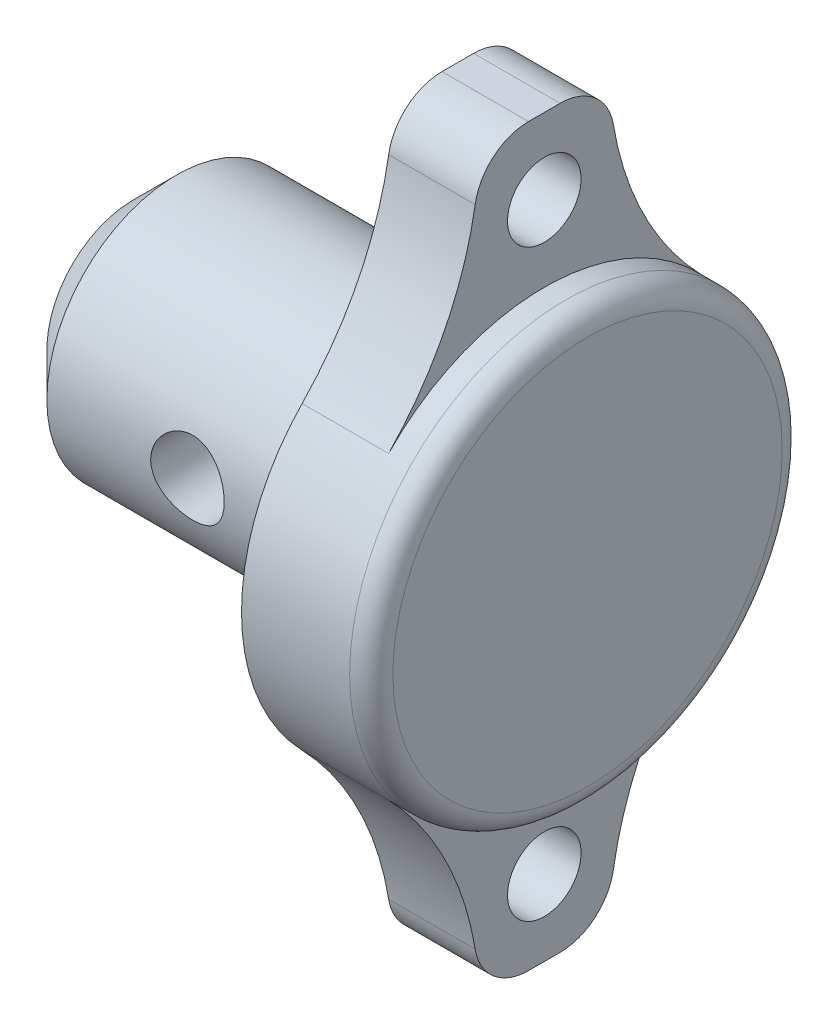
ISO-10303-21;
HEADER;
FILE_DESCRIPTION(('STEP AP214'),'2;1');
FILE_NAME('part.step','',(''),(''),'','','');
FILE_SCHEMA(('AUTOMOTIVE_DESIGN { 1 0 10303 214 1 1 1 1 }'));
ENDSEC;
DATA;
#1=APPLICATION_CONTEXT('core data for automotive mechanical design processes');
#2=APPLICATION_PROTOCOL_DEFINITION('international standard','automotive_design',2000,#1);
#3=PRODUCT_CONTEXT('',#1,'mechanical');
#4=PRODUCT('Part','Part','',(#3));
#5=PRODUCT_RELATED_PRODUCT_CATEGORY('part','',(#4));
#6=PRODUCT_DEFINITION_FORMATION('','',#4);
#7=PRODUCT_DEFINITION_CONTEXT('part definition',#1,'design');
#8=PRODUCT_DEFINITION('design','',#6,#7);
#9=PRODUCT_DEFINITION_SHAPE('','',#8);
#10=(LENGTH_UNIT() NAMED_UNIT(*) SI_UNIT(.MILLI.,.METRE.));
#11=(NAMED_UNIT(*) PLANE_ANGLE_UNIT() SI_UNIT($,.RADIAN.));
#12=(NAMED_UNIT(*) SI_UNIT($,.STERADIAN.) SOLID_ANGLE_UNIT());
#13=UNCERTAINTY_MEASURE_WITH_UNIT(LENGTH_MEASURE(1.E-05),#10,'distance_accuracy_value','');
#14=(GEOMETRIC_REPRESENTATION_CONTEXT(3) GLOBAL_UNCERTAINTY_ASSIGNED_CONTEXT((#13)) GLOBAL_UNIT_ASSIGNED_CONTEXT((#10,
#11,#12)) REPRESENTATION_CONTEXT('',''));
#15=CARTESIAN_POINT('',(0.,0.,0.));
#16=DIRECTION('',(0.,0.,1.));
#17=DIRECTION('',(1.,0.,0.));
#18=AXIS2_PLACEMENT_3D('',#15,#16,#17);
#19=CARTESIAN_POINT('',(13.5,0.,0.));
#20=DIRECTION('',(-1.,0.,0.));
#21=DIRECTION('',(0.,0.,1.));
#22=AXIS2_PLACEMENT_3D('',#19,#20,#21);
#23=CYLINDRICAL_SURFACE('',#22,10.);
#24=CARTESIAN_POINT('',(12.5,0.,0.));
#25=DIRECTION('',(1.,0.,0.));
#26=DIRECTION('',(0.,0.,-1.));
#27=AXIS2_PLACEMENT_3D('',#24,#25,#26);
#28=CIRCLE('',#27,10.);
#29=CARTESIAN_POINT('',(12.5,0.,-10.));
#30=VERTEX_POINT('',#29);
#31=EDGE_CURVE('E11',#30,#30,#28,.F.);
#32=ORIENTED_EDGE('',*,*,#31,.T.);
#33=EDGE_LOOP('',(#32));
#34=FACE_BOUND('',#33,.T.);
#35=CARTESIAN_POINT('',(11.5,0.,0.));
#36=DIRECTION('',(-1.,0.,0.));
#37=DIRECTION('',(0.,0.,1.));
#38=AXIS2_PLACEMENT_3D('',#35,#36,#37);
#39=CIRCLE('',#38,10.);
#40=CARTESIAN_POINT('',(11.5,6.94147083499404,7.19833193503378));
#41=VERTEX_POINT('',#40);
#42=CARTESIAN_POINT('',(11.5,6.94147083499404,-7.19833193503378));
#43=VERTEX_POINT('',#42);
#44=EDGE_CURVE('E288',#41,#43,#39,.T.);
#45=ORIENTED_EDGE('',*,*,#44,.F.);
#46=DIRECTION('',(-1.,0.,0.));
#47=VECTOR('',#46,1.);
#48=CARTESIAN_POINT('',(13.5,6.94147083499404,7.19833193503378));
#49=LINE('',#48,#47);
#50=CARTESIAN_POINT('',(7.5,6.94147083499404,7.19833193503378));
#51=VERTEX_POINT('',#50);
#52=EDGE_CURVE('E285',#41,#51,#49,.T.);
#53=ORIENTED_EDGE('',*,*,#52,.T.);
#54=CARTESIAN_POINT('',(7.5,0.,0.));
#55=DIRECTION('',(1.,0.,0.));
#56=DIRECTION('',(0.,0.,-1.));
#57=AXIS2_PLACEMENT_3D('',#54,#55,#56);
#58=CIRCLE('',#57,10.);
#59=CARTESIAN_POINT('',(7.5,-6.94147083499404,7.19833193503378));
#60=VERTEX_POINT('',#59);
#61=EDGE_CURVE('E155',#51,#60,#58,.T.);
#62=ORIENTED_EDGE('',*,*,#61,.T.);
#63=DIRECTION('',(-1.,0.,0.));
#64=VECTOR('',#63,1.);
#65=CARTESIAN_POINT('',(13.5,-6.94147083499404,7.19833193503378));
#66=LINE('',#65,#64);
#67=CARTESIAN_POINT('',(11.5,-6.94147083499404,7.19833193503378));
#68=VERTEX_POINT('',#67);
#69=EDGE_CURVE('E148',#60,#68,#66,.F.);
#70=ORIENTED_EDGE('',*,*,#69,.T.);
#71=CARTESIAN_POINT('',(11.5,0.,0.));
#72=DIRECTION('',(1.,0.,0.));
#73=DIRECTION('',(0.,0.,1.));
#74=AXIS2_PLACEMENT_3D('',#71,#72,#73);
#75=CIRCLE('',#74,10.);
#76=CARTESIAN_POINT('',(11.5,-6.94147083499404,-7.19833193503378));
#77=VERTEX_POINT('',#76);
#78=EDGE_CURVE('E147',#68,#77,#75,.T.);
#79=ORIENTED_EDGE('',*,*,#78,.T.);
#80=DIRECTION('',(-1.,0.,0.));
#81=VECTOR('',#80,1.);
#82=CARTESIAN_POINT('',(13.5,-6.94147083499404,-7.19833193503378));
#83=LINE('',#82,#81);
#84=CARTESIAN_POINT('',(7.5,-6.94147083499404,-7.19833193503378));
#85=VERTEX_POINT('',#84);
#86=EDGE_CURVE('E131',#77,#85,#83,.T.);
#87=ORIENTED_EDGE('',*,*,#86,.T.);
#88=CARTESIAN_POINT('',(7.5,6.94147083499404,-7.19833193503378));
#89=VERTEX_POINT('',#88);
#90=EDGE_CURVE('E144',#85,#89,#58,.T.);
#91=ORIENTED_EDGE('',*,*,#90,.T.);
#92=DIRECTION('',(-1.,0.,0.));
#93=VECTOR('',#92,1.);
#94=CARTESIAN_POINT('',(13.5,6.94147083499404,-7.19833193503378));
#95=LINE('',#94,#93);
#96=EDGE_CURVE('E168',#89,#43,#95,.F.);
#97=ORIENTED_EDGE('',*,*,#96,.T.);
#98=EDGE_LOOP('',(#45,#53,#62,#70,#79,#87,#91,#97));
#99=FACE_BOUND('',#98,.T.);
#100=ADVANCED_FACE('F34',(#34,#99),#23,.T.);
#101=CARTESIAN_POINT('',(13.5,0.,0.));
#102=DIRECTION('',(1.,0.,0.));
#103=DIRECTION('',(0.,0.,-1.));
#104=AXIS2_PLACEMENT_3D('',#101,#102,#103);
#105=PLANE('',#104);
#106=CARTESIAN_POINT('',(13.5,0.,0.));
#107=DIRECTION('',(1.,0.,0.));
#108=DIRECTION('',(0.,0.,-1.));
#109=AXIS2_PLACEMENT_3D('',#106,#107,#108);
#110=CIRCLE('',#109,9.);
#111=CARTESIAN_POINT('',(13.5,0.,-9.));
#112=VERTEX_POINT('',#111);
#113=EDGE_CURVE('E42',#112,#112,#110,.T.);
#114=ORIENTED_EDGE('',*,*,#113,.T.);
#115=EDGE_LOOP('',(#114));
#116=FACE_BOUND('',#115,.T.);
#117=ADVANCED_FACE('F219',(#116),#105,.T.);
#118=CARTESIAN_POINT('',(7.5,0.,0.));
#119=DIRECTION('',(1.,0.,0.));
#120=DIRECTION('',(0.,0.,-1.));
#121=AXIS2_PLACEMENT_3D('',#118,#119,#120);
#122=PLANE('',#121);
#123=CARTESIAN_POINT('',(7.5,0.,0.));
#124=DIRECTION('',(-1.,0.,0.));
#125=DIRECTION('',(0.,0.,1.));
#126=AXIS2_PLACEMENT_3D('',#123,#124,#125);
#127=CIRCLE('',#126,8.5);
#128=CARTESIAN_POINT('',(7.5,0.,8.5));
#129=VERTEX_POINT('',#128);
#130=EDGE_CURVE('E160',#129,#129,#127,.T.);
#131=ORIENTED_EDGE('',*,*,#130,.F.);
#132=EDGE_LOOP('',(#131));
#133=FACE_BOUND('',#132,.T.);
#134=DIRECTION('',(0.,0.,1.));
#135=VECTOR('',#134,1.);
#136=CARTESIAN_POINT('',(7.5,17.,3.));
#137=LINE('',#136,#135);
#138=CARTESIAN_POINT('',(7.5,17.,-0.730068137608321));
#139=VERTEX_POINT('',#138);
#140=CARTESIAN_POINT('',(7.5,17.,0.730068137608328));
#141=VERTEX_POINT('',#140);
#142=EDGE_CURVE('E303',#139,#141,#137,.T.);
#143=ORIENTED_EDGE('',*,*,#142,.F.);
#144=CARTESIAN_POINT('',(7.5,14.5,-0.730068137608321));
#145=DIRECTION('',(1.,0.,0.));
#146=DIRECTION('',(0.,0.,-1.));
#147=AXIS2_PLACEMENT_3D('',#144,#145,#146);
#148=CIRCLE('',#147,2.5);
#149=CARTESIAN_POINT('',(7.5,14.907668155355,-3.1966055233192));
#150=VERTEX_POINT('',#149);
#151=EDGE_CURVE('E263',#139,#150,#148,.F.);
#152=ORIENTED_EDGE('',*,*,#151,.T.);
#153=CARTESIAN_POINT('',(7.5,17.3536770874851,-17.9958298375844));
#154=DIRECTION('',(1.,0.,0.));
#155=DIRECTION('',(0.,0.,-1.));
#156=AXIS2_PLACEMENT_3D('',#153,#154,#155);
#157=CIRCLE('',#156,15.);
#158=EDGE_CURVE('E154',#150,#89,#157,.T.);
#159=ORIENTED_EDGE('',*,*,#158,.T.);
#160=ORIENTED_EDGE('',*,*,#90,.F.);
#161=CARTESIAN_POINT('',(7.5,-17.3536770874851,-17.9958298375844));
#162=DIRECTION('',(1.,0.,0.));
#163=DIRECTION('',(0.,0.,-1.));
#164=AXIS2_PLACEMENT_3D('',#161,#162,#163);
#165=CIRCLE('',#164,15.);
#166=CARTESIAN_POINT('',(7.5,-14.907668155355,-3.1966055233192));
#167=VERTEX_POINT('',#166);
#168=EDGE_CURVE('E127',#85,#167,#165,.T.);
#169=ORIENTED_EDGE('',*,*,#168,.T.);
#170=CARTESIAN_POINT('',(7.5,-14.5,-0.730068137608321));
#171=DIRECTION('',(1.,0.,0.));
#172=DIRECTION('',(0.,0.,-1.));
#173=AXIS2_PLACEMENT_3D('',#170,#171,#172);
#174=CIRCLE('',#173,2.5);
#175=CARTESIAN_POINT('',(7.5,-17.,-0.730068137608321));
#176=VERTEX_POINT('',#175);
#177=EDGE_CURVE('E267',#167,#176,#174,.F.);
#178=ORIENTED_EDGE('',*,*,#177,.T.);
#179=DIRECTION('',(0.,0.,1.));
#180=VECTOR('',#179,1.);
#181=CARTESIAN_POINT('',(7.5,-17.,3.));
#182=LINE('',#181,#180);
#183=CARTESIAN_POINT('',(7.5,-17.,0.730068137608328));
#184=VERTEX_POINT('',#183);
#185=EDGE_CURVE('E316',#176,#184,#182,.T.);
#186=ORIENTED_EDGE('',*,*,#185,.T.);
#187=CARTESIAN_POINT('',(7.5,-14.5,0.730068137608328));
#188=DIRECTION('',(1.,0.,0.));
#189=DIRECTION('',(0.,0.,-1.));
#190=AXIS2_PLACEMENT_3D('',#187,#188,#189);
#191=CIRCLE('',#190,2.5);
#192=CARTESIAN_POINT('',(7.5,-14.907668155355,3.1966055233192));
#193=VERTEX_POINT('',#192);
#194=EDGE_CURVE('E269',#184,#193,#191,.F.);
#195=ORIENTED_EDGE('',*,*,#194,.T.);
#196=CARTESIAN_POINT('',(7.5,-17.3536770874851,17.9958298375845));
#197=DIRECTION('',(1.,0.,0.));
#198=DIRECTION('',(0.,0.,-1.));
#199=AXIS2_PLACEMENT_3D('',#196,#197,#198);
#200=CIRCLE('',#199,15.);
#201=EDGE_CURVE('E164',#193,#60,#200,.T.);
#202=ORIENTED_EDGE('',*,*,#201,.T.);
#203=ORIENTED_EDGE('',*,*,#61,.F.);
#204=CARTESIAN_POINT('',(7.5,17.3536770874851,17.9958298375845));
#205=DIRECTION('',(1.,0.,0.));
#206=DIRECTION('',(0.,0.,-1.));
#207=AXIS2_PLACEMENT_3D('',#204,#205,#206);
#208=CIRCLE('',#207,15.);
#209=CARTESIAN_POINT('',(7.5,14.907668155355,3.1966055233192));
#210=VERTEX_POINT('',#209);
#211=EDGE_CURVE('E282',#51,#210,#208,.T.);
#212=ORIENTED_EDGE('',*,*,#211,.T.);
#213=CARTESIAN_POINT('',(7.5,14.5,0.730068137608328));
#214=DIRECTION('',(1.,0.,0.));
#215=DIRECTION('',(0.,0.,-1.));
#216=AXIS2_PLACEMENT_3D('',#213,#214,#215);
#217=CIRCLE('',#216,2.5);
#218=EDGE_CURVE('E265',#210,#141,#217,.F.);
#219=ORIENTED_EDGE('',*,*,#218,.T.);
#220=EDGE_LOOP('',(#143,#152,#159,#160,#169,#178,#186,#195,#202,#203,#212,#219));
#221=FACE_BOUND('',#220,.T.);
#222=CARTESIAN_POINT('',(7.5,-13.5,0.));
#223=DIRECTION('',(-1.,0.,0.));
#224=DIRECTION('',(0.,0.,1.));
#225=AXIS2_PLACEMENT_3D('',#222,#223,#224);
#226=CIRCLE('',#225,1.7);
#227=CARTESIAN_POINT('',(7.5,-13.5,1.7));
#228=VERTEX_POINT('',#227);
#229=EDGE_CURVE('E317',#228,#228,#226,.T.);
#230=ORIENTED_EDGE('',*,*,#229,.F.);
#231=EDGE_LOOP('',(#230));
#232=FACE_BOUND('',#231,.T.);
#233=CARTESIAN_POINT('',(7.5,13.5,0.));
#234=DIRECTION('',(1.,0.,0.));
#235=DIRECTION('',(0.,0.,1.));
#236=AXIS2_PLACEMENT_3D('',#233,#234,#235);
#237=CIRCLE('',#236,1.7);
#238=CARTESIAN_POINT('',(7.5,13.5,1.7));
#239=VERTEX_POINT('',#238);
#240=EDGE_CURVE('E309',#239,#239,#237,.T.);
#241=ORIENTED_EDGE('',*,*,#240,.T.);
#242=EDGE_LOOP('',(#241));
#243=FACE_BOUND('',#242,.T.);
#244=ADVANCED_FACE('F151',(#133,#221,#232,#243),#122,.F.);
#245=CARTESIAN_POINT('',(10.,0.,0.));
#246=DIRECTION('',(-1.,0.,0.));
#247=DIRECTION('',(0.,0.,1.));
#248=AXIS2_PLACEMENT_3D('',#245,#246,#247);
#249=CYLINDRICAL_SURFACE('',#248,8.5);
#250=CARTESIAN_POINT('',(10.,0.,0.));
#251=DIRECTION('',(-1.,0.,0.));
#252=DIRECTION('',(0.,0.,1.));
#253=AXIS2_PLACEMENT_3D('',#250,#251,#252);
#254=CIRCLE('',#253,8.5);
#255=CARTESIAN_POINT('',(10.,0.,8.5));
#256=VERTEX_POINT('',#255);
#257=EDGE_CURVE('E158',#256,#256,#254,.T.);
#258=ORIENTED_EDGE('',*,*,#257,.F.);
#259=EDGE_LOOP('',(#258));
#260=FACE_BOUND('',#259,.T.);
#261=ORIENTED_EDGE('',*,*,#130,.T.);
#262=EDGE_LOOP('',(#261));
#263=FACE_BOUND('',#262,.T.);
#264=ADVANCED_FACE('F214',(#260,#263),#249,.F.);
#265=CARTESIAN_POINT('',(10.,0.,0.));
#266=DIRECTION('',(-1.,0.,0.));
#267=DIRECTION('',(0.,0.,1.));
#268=AXIS2_PLACEMENT_3D('',#265,#266,#267);
#269=PLANE('',#268);
#270=CARTESIAN_POINT('',(10.,0.,0.));
#271=DIRECTION('',(-1.,0.,0.));
#272=DIRECTION('',(0.,0.,1.));
#273=AXIS2_PLACEMENT_3D('',#270,#271,#272);
#274=CIRCLE('',#273,6.);
#275=CARTESIAN_POINT('',(10.,0.,6.));
#276=VERTEX_POINT('',#275);
#277=EDGE_CURVE('E323',#276,#276,#274,.T.);
#278=ORIENTED_EDGE('',*,*,#277,.F.);
#279=EDGE_LOOP('',(#278));
#280=FACE_BOUND('',#279,.T.);
#281=ORIENTED_EDGE('',*,*,#257,.T.);
#282=EDGE_LOOP('',(#281));
#283=FACE_BOUND('',#282,.T.);
#284=ADVANCED_FACE('F210',(#280,#283),#269,.T.);
#285=CARTESIAN_POINT('',(-7.5,0.,0.));
#286=DIRECTION('',(1.,0.,0.));
#287=DIRECTION('',(0.,0.,-1.));
#288=AXIS2_PLACEMENT_3D('',#285,#286,#287);
#289=PLANE('',#288);
#290=CARTESIAN_POINT('',(-7.5,0.,0.));
#291=DIRECTION('',(1.,0.,0.));
#292=DIRECTION('',(0.,0.,-1.));
#293=AXIS2_PLACEMENT_3D('',#290,#291,#292);
#294=CIRCLE('',#293,3.99999999999999);
#295=CARTESIAN_POINT('',(-7.5,0.,-3.99999999999999));
#296=VERTEX_POINT('',#295);
#297=EDGE_CURVE('E236',#296,#296,#294,.F.);
#298=ORIENTED_EDGE('',*,*,#297,.T.);
#299=EDGE_LOOP('',(#298));
#300=FACE_BOUND('',#299,.T.);
#301=ADVANCED_FACE('F213',(#300),#289,.F.);
#302=CARTESIAN_POINT('',(7.5,0.,0.));
#303=DIRECTION('',(-1.,0.,0.));
#304=DIRECTION('',(0.,0.,1.));
#305=AXIS2_PLACEMENT_3D('',#302,#303,#304);
#306=CYLINDRICAL_SURFACE('',#305,6.);
#307=CARTESIAN_POINT('',(-5.5,0.,0.));
#308=DIRECTION('',(1.,0.,0.));
#309=DIRECTION('',(0.,0.,-1.));
#310=AXIS2_PLACEMENT_3D('',#307,#308,#309);
#311=CIRCLE('',#310,6.);
#312=CARTESIAN_POINT('',(-5.5,0.,-6.));
#313=VERTEX_POINT('',#312);
#314=EDGE_CURVE('E238',#313,#313,#311,.T.);
#315=ORIENTED_EDGE('',*,*,#314,.T.);
#316=EDGE_LOOP('',(#315));
#317=FACE_BOUND('',#316,.T.);
#318=CARTESIAN_POINT('',(2.7,0.,6.));
#319=CARTESIAN_POINT('',(2.69999827257656,-0.0934943615034012,5.99999884474973));
#320=CARTESIAN_POINT('',(2.69226144726259,-0.187006564522406,5.99779348954783));
#321=CARTESIAN_POINT('',(2.66158237131767,-0.371322769901869,5.98921065514552));
#322=CARTESIAN_POINT('',(2.63863416706838,-0.462125697324879,5.9828315423807));
#323=CARTESIAN_POINT('',(2.57834909427065,-0.638337255167614,5.96660280778705));
#324=CARTESIAN_POINT('',(2.54103209511171,-0.72375314587583,5.95675798000671));
#325=CARTESIAN_POINT('',(2.45314623450544,-0.887114983810657,5.93462982256613));
#326=CARTESIAN_POINT('',(2.40257604953212,-0.965060183916337,5.92234624939093));
#327=CARTESIAN_POINT('',(2.28823799703864,-1.11328637042325,5.89630337319782));
#328=CARTESIAN_POINT('',(2.22419005108989,-1.18334643738983,5.88251635209784));
#329=CARTESIAN_POINT('',(2.08531237424007,-1.31188873147318,5.855192174518));
#330=CARTESIAN_POINT('',(2.01048106015959,-1.37036925552041,5.84165505505769));
#331=CARTESIAN_POINT('',(1.85034613797822,-1.47521073956825,5.81607525435004));
#332=CARTESIAN_POINT('',(1.76486516017767,-1.52131004368505,5.80406729594488));
#333=CARTESIAN_POINT('',(1.58696976467728,-1.5983922398814,5.78331625999126));
#334=CARTESIAN_POINT('',(1.49455681554212,-1.62937832337737,5.77457249324418));
#335=CARTESIAN_POINT('',(1.3078845980668,-1.67457292272021,5.76162732490899));
#336=CARTESIAN_POINT('',(1.21373087719834,-1.68918533732791,5.75731679770698));
#337=CARTESIAN_POINT('',(1.02421729173523,-1.70247807029528,5.75340078755233));
#338=CARTESIAN_POINT('',(0.928857688755669,-1.701161787085,5.7537943009799));
#339=CARTESIAN_POINT('',(0.742854678836455,-1.68295347341345,5.7591447009774));
#340=CARTESIAN_POINT('',(0.652157755737527,-1.66655840082521,5.76395598115783));
#341=CARTESIAN_POINT('',(0.474858143945474,-1.6194572353209,5.77736548810719));
#342=CARTESIAN_POINT('',(0.388255820635804,-1.58874986788554,5.78596405213248));
#343=CARTESIAN_POINT('',(0.220347380346021,-1.51351000123897,5.80610149854683));
#344=CARTESIAN_POINT('',(0.139120886376898,-1.46880968051772,5.81767575077005));
#345=CARTESIAN_POINT('',(-0.0148489487733143,-1.36696961936581,5.84244242021042));
#346=CARTESIAN_POINT('',(-0.0875904236817384,-1.30982715018845,5.8556351921153));
#347=CARTESIAN_POINT('',(-0.225354944278259,-1.1822192440219,5.88275097092072));
#348=CARTESIAN_POINT('',(-0.28999242452938,-1.11133880736879,5.89668292807973));
#349=CARTESIAN_POINT('',(-0.406547682255653,-0.959571971132524,5.92327174812674));
#350=CARTESIAN_POINT('',(-0.458464822119334,-0.878685070277584,5.93592854707829));
#351=CARTESIAN_POINT('',(-0.548306215741749,-0.708554093591207,5.95863625978762));
#352=CARTESIAN_POINT('',(-0.586153059859388,-0.619267075909292,5.96867266972164));
#353=CARTESIAN_POINT('',(-0.646183678571939,-0.435246656631164,5.98490423413323));
#354=CARTESIAN_POINT('',(-0.668371333226229,-0.340514610508734,5.99110034012117));
#355=CARTESIAN_POINT('',(-0.695830668900755,-0.151577478778789,5.99880603608526));
#356=CARTESIAN_POINT('',(-0.701625721825776,-0.0574542537963866,6.00046057332172));
#357=CARTESIAN_POINT('',(-0.697591204441606,0.130421977345627,5.9993175792947));
#358=CARTESIAN_POINT('',(-0.687763475140382,0.224175025822194,5.99652057260661));
#359=CARTESIAN_POINT('',(-0.653188924092887,0.406729377316999,5.98688305950992));
#360=CARTESIAN_POINT('',(-0.628740786388524,0.495591923936864,5.98012355710591));
#361=CARTESIAN_POINT('',(-0.565972324126039,0.667940689340888,5.96333456274326));
#362=CARTESIAN_POINT('',(-0.527650406914014,0.75142628957672,5.95330469537305));
#363=CARTESIAN_POINT('',(-0.437296727112403,0.91263270970203,5.93075651627411));
#364=CARTESIAN_POINT('',(-0.384989188834524,0.990191980587499,5.91818955622035));
#365=CARTESIAN_POINT('',(-0.268489976104551,1.13561335455067,5.89201584767508));
#366=CARTESIAN_POINT('',(-0.204295643566763,1.20347328266756,5.87840886701804));
#367=CARTESIAN_POINT('',(-0.063392937972921,1.32982443029663,5.85114386688352));
#368=CARTESIAN_POINT('',(0.013651209472902,1.38794463053242,5.83749825142035));
#369=CARTESIAN_POINT('',(0.17669281369744,1.49044819284287,5.81217362193036));
#370=CARTESIAN_POINT('',(0.262689948727695,1.53483204834056,5.8004945372707));
#371=CARTESIAN_POINT('',(0.440828399376133,1.60827718214857,5.78056173167497));
#372=CARTESIAN_POINT('',(0.532933542717278,1.63742092705125,5.77228962787091));
#373=CARTESIAN_POINT('',(0.721016522241371,1.67971782463611,5.7601251451254));
#374=CARTESIAN_POINT('',(0.816993200471226,1.69287572248445,5.75623146653765));
#375=CARTESIAN_POINT('',(1.00627001476008,1.70252951716923,5.75338292703647));
#376=CARTESIAN_POINT('',(1.09953728637873,1.69962567840782,5.75425013160161));
#377=CARTESIAN_POINT('',(1.28419429237689,1.67865052041337,5.76040357418625));
#378=CARTESIAN_POINT('',(1.37558408737539,1.66057969167523,5.76568966930041));
#379=CARTESIAN_POINT('',(1.5530269910296,1.61015145481415,5.77997263333106));
#380=CARTESIAN_POINT('',(1.6391238371912,1.57793668021413,5.78893239723693));
#381=CARTESIAN_POINT('',(1.80475829364648,1.50024531465022,5.80955007293793));
#382=CARTESIAN_POINT('',(1.88429475614293,1.45476640929609,5.82120845552789));
#383=CARTESIAN_POINT('',(2.03737751931617,1.35008379150968,5.8463884630186));
#384=CARTESIAN_POINT('',(2.11064083646234,1.29047793558559,5.85995875148063));
#385=CARTESIAN_POINT('',(2.24632007551774,1.1599781975744,5.88717982502643));
#386=CARTESIAN_POINT('',(2.30873327463631,1.08908149062452,5.9008306294293));
#387=CARTESIAN_POINT('',(2.42249103235592,0.935867716703179,5.92708482484926));
#388=CARTESIAN_POINT('',(2.47351858339861,0.853308739764468,5.93965334227066));
#389=CARTESIAN_POINT('',(2.56089262257089,0.680428083863563,5.96192854356138));
#390=CARTESIAN_POINT('',(2.59724731644336,0.590110778092927,5.97163682618414));
#391=CARTESIAN_POINT('',(2.65021388257585,0.416948403338608,5.98603807698347));
#392=CARTESIAN_POINT('',(2.66883690968153,0.334755102796878,5.99123321349682));
#393=CARTESIAN_POINT('',(2.69372995029414,0.168379186148406,5.99821447554217));
#394=CARTESIAN_POINT('',(2.70000155564006,0.0841968278048554,6.00000104036657));
#395=CARTESIAN_POINT('',(2.7,0.,6.));
#396=B_SPLINE_CURVE_WITH_KNOTS('',3,(#318,#319,#320,#321,#322,#323,#324,#325,#326,#327,#328,
#329,#330,#331,#332,#333,#334,#335,#336,#337,#338,#339,#340,#341,#342,#343,#344,#345,#346,#347,
#348,#349,#350,#351,#352,#353,#354,#355,#356,#357,#358,#359,#360,#361,#362,#363,#364,#365,#366,
#367,#368,#369,#370,#371,#372,#373,#374,#375,#376,#377,#378,#379,#380,#381,#382,#383,#384,#385,
#386,#387,#388,#389,#390,#391,#392,#393,#394,#395),.UNSPECIFIED.,.T.,.F.,(4,2,2,2,2,2,2,2,2,2,2,
2,2,2,2,2,2,2,2,2,2,2,2,2,2,2,2,2,2,2,2,2,2,2,2,2,2,2,4),(0.,0.280174071102462,
0.560457865011478,0.84035546210045,1.12028102174913,1.40672953049703,1.69322013762187,
1.98535867662736,2.27743549881932,2.56213698300402,2.84677772644094,3.12236111340167,
3.39796904593474,3.67701797004889,3.95612815546202,4.24557394804681,4.53503424623542,
4.82606427553573,5.11702216760168,5.39857959937197,5.68010385452596,5.95606435426587,
6.23205654320785,6.51395347645871,6.79591352286414,7.0869318850341,7.37793979232426,
7.66735627667048,7.95668683093711,8.23527925900378,8.51386267784062,8.78969905467389,
9.06558358960692,9.3505402059299,9.63556822799412,9.92774771861145,10.2197635817238,
10.4721083055922,10.7244205053941),.UNSPECIFIED.);
#397=CARTESIAN_POINT('',(2.7,0.,6.));
#398=VERTEX_POINT('',#397);
#399=EDGE_CURVE('E177',#398,#398,#396,.T.);
#400=ORIENTED_EDGE('',*,*,#399,.T.);
#401=EDGE_LOOP('',(#400));
#402=FACE_BOUND('',#401,.T.);
#403=CARTESIAN_POINT('',(2.7,0.,-6.));
#404=CARTESIAN_POINT('',(2.69999827257656,0.0934943615034011,-5.99999884474973));
#405=CARTESIAN_POINT('',(2.69226144726259,0.187006564522406,-5.99779348954783));
#406=CARTESIAN_POINT('',(2.66158237131767,0.371322769901869,-5.98921065514552));
#407=CARTESIAN_POINT('',(2.63863416706838,0.462125697324879,-5.9828315423807));
#408=CARTESIAN_POINT('',(2.57834909427065,0.638337255167614,-5.96660280778705));
#409=CARTESIAN_POINT('',(2.54103209511171,0.72375314587583,-5.95675798000671));
#410=CARTESIAN_POINT('',(2.45314623450544,0.887114983810657,-5.93462982256612));
#411=CARTESIAN_POINT('',(2.40257604953212,0.965060183916337,-5.92234624939093));
#412=CARTESIAN_POINT('',(2.28823799703864,1.11328637042325,-5.89630337319782));
#413=CARTESIAN_POINT('',(2.2241900510899,1.18334643738983,-5.88251635209784));
#414=CARTESIAN_POINT('',(2.08531237424007,1.31188873147318,-5.855192174518));
#415=CARTESIAN_POINT('',(2.01048106015959,1.37036925552041,-5.84165505505769));
#416=CARTESIAN_POINT('',(1.85034613797822,1.47521073956825,-5.81607525435004));
#417=CARTESIAN_POINT('',(1.76486516017767,1.52131004368505,-5.80406729594488));
#418=CARTESIAN_POINT('',(1.58696976467728,1.5983922398814,-5.78331625999126));
#419=CARTESIAN_POINT('',(1.49455681554212,1.62937832337737,-5.77457249324418));
#420=CARTESIAN_POINT('',(1.3078845980668,1.67457292272021,-5.76162732490899));
#421=CARTESIAN_POINT('',(1.21373087719834,1.68918533732791,-5.75731679770698));
#422=CARTESIAN_POINT('',(1.02421729173523,1.70247807029528,-5.75340078755233));
#423=CARTESIAN_POINT('',(0.92885768875567,1.701161787085,-5.7537943009799));
#424=CARTESIAN_POINT('',(0.742854678836455,1.68295347341345,-5.7591447009774));
#425=CARTESIAN_POINT('',(0.652157755737527,1.66655840082521,-5.76395598115783));
#426=CARTESIAN_POINT('',(0.474858143945474,1.6194572353209,-5.77736548810719));
#427=CARTESIAN_POINT('',(0.388255820635804,1.58874986788554,-5.78596405213248));
#428=CARTESIAN_POINT('',(0.22034738034602,1.51351000123897,-5.80610149854683));
#429=CARTESIAN_POINT('',(0.139120886376898,1.46880968051772,-5.81767575077005));
#430=CARTESIAN_POINT('',(-0.014848948773315,1.36696961936581,-5.84244242021042));
#431=CARTESIAN_POINT('',(-0.0875904236817389,1.30982715018844,-5.8556351921153));
#432=CARTESIAN_POINT('',(-0.225354944278259,1.1822192440219,-5.88275097092072));
#433=CARTESIAN_POINT('',(-0.289992424529381,1.11133880736879,-5.89668292807973));
#434=CARTESIAN_POINT('',(-0.406547682255654,0.959571971132523,-5.92327174812674));
#435=CARTESIAN_POINT('',(-0.458464822119335,0.878685070277584,-5.93592854707829));
#436=CARTESIAN_POINT('',(-0.548306215741749,0.708554093591207,-5.95863625978762));
#437=CARTESIAN_POINT('',(-0.586153059859388,0.619267075909292,-5.96867266972164));
#438=CARTESIAN_POINT('',(-0.646183678571939,0.435246656631163,-5.98490423413323));
#439=CARTESIAN_POINT('',(-0.668371333226229,0.340514610508733,-5.99110034012117));
#440=CARTESIAN_POINT('',(-0.695830668900755,0.151577478778789,-5.99880603608526));
#441=CARTESIAN_POINT('',(-0.701625721825776,0.0574542537963867,-6.00046057332172));
#442=CARTESIAN_POINT('',(-0.697591204441606,-0.130421977345627,-5.9993175792947));
#443=CARTESIAN_POINT('',(-0.687763475140382,-0.224175025822194,-5.99652057260661));
#444=CARTESIAN_POINT('',(-0.653188924092887,-0.406729377316998,-5.98688305950992));
#445=CARTESIAN_POINT('',(-0.628740786388524,-0.495591923936864,-5.98012355710591));
#446=CARTESIAN_POINT('',(-0.565972324126039,-0.667940689340887,-5.96333456274326));
#447=CARTESIAN_POINT('',(-0.527650406914014,-0.751426289576719,-5.95330469537305));
#448=CARTESIAN_POINT('',(-0.437296727112403,-0.91263270970203,-5.93075651627411));
#449=CARTESIAN_POINT('',(-0.384989188834525,-0.990191980587498,-5.91818955622034));
#450=CARTESIAN_POINT('',(-0.268489976104552,-1.13561335455067,-5.89201584767508));
#451=CARTESIAN_POINT('',(-0.204295643566764,-1.20347328266756,-5.87840886701804));
#452=CARTESIAN_POINT('',(-0.0633929379729218,-1.32982443029663,-5.85114386688352));
#453=CARTESIAN_POINT('',(0.013651209472901,-1.38794463053242,-5.83749825142035));
#454=CARTESIAN_POINT('',(0.176692813697439,-1.49044819284287,-5.81217362193036));
#455=CARTESIAN_POINT('',(0.262689948727694,-1.53483204834056,-5.8004945372707));
#456=CARTESIAN_POINT('',(0.440828399376132,-1.60827718214857,-5.78056173167497));
#457=CARTESIAN_POINT('',(0.532933542717277,-1.63742092705125,-5.77228962787091));
#458=CARTESIAN_POINT('',(0.72101652224137,-1.67971782463611,-5.7601251451254));
#459=CARTESIAN_POINT('',(0.816993200471225,-1.69287572248445,-5.75623146653765));
#460=CARTESIAN_POINT('',(1.00627001476008,-1.70252951716923,-5.75338292703647));
#461=CARTESIAN_POINT('',(1.09953728637873,-1.69962567840782,-5.75425013160161));
#462=CARTESIAN_POINT('',(1.28419429237689,-1.67865052041337,-5.76040357418625));
#463=CARTESIAN_POINT('',(1.37558408737539,-1.66057969167523,-5.76568966930041));
#464=CARTESIAN_POINT('',(1.5530269910296,-1.61015145481415,-5.77997263333106));
#465=CARTESIAN_POINT('',(1.6391238371912,-1.57793668021413,-5.78893239723693));
#466=CARTESIAN_POINT('',(1.80475829364648,-1.50024531465022,-5.80955007293793));
#467=CARTESIAN_POINT('',(1.88429475614293,-1.45476640929609,-5.82120845552789));
#468=CARTESIAN_POINT('',(2.03737751931617,-1.35008379150968,-5.8463884630186));
#469=CARTESIAN_POINT('',(2.11064083646234,-1.29047793558559,-5.85995875148063));
#470=CARTESIAN_POINT('',(2.24632007551774,-1.1599781975744,-5.88717982502643));
#471=CARTESIAN_POINT('',(2.30873327463631,-1.08908149062452,-5.9008306294293));
#472=CARTESIAN_POINT('',(2.42249103235592,-0.935867716703179,-5.92708482484926));
#473=CARTESIAN_POINT('',(2.47351858339861,-0.853308739764468,-5.93965334227066));
#474=CARTESIAN_POINT('',(2.56089262257089,-0.680428083863563,-5.96192854356138));
#475=CARTESIAN_POINT('',(2.59724731644336,-0.590110778092927,-5.97163682618414));
#476=CARTESIAN_POINT('',(2.65021388257585,-0.416948403338608,-5.98603807698347));
#477=CARTESIAN_POINT('',(2.66883690968153,-0.334755102796878,-5.99123321349682));
#478=CARTESIAN_POINT('',(2.69372995029414,-0.168379186148406,-5.99821447554217));
#479=CARTESIAN_POINT('',(2.70000155564006,-0.0841968278048556,-6.00000104036657));
#480=CARTESIAN_POINT('',(2.7,0.,-6.));
#481=B_SPLINE_CURVE_WITH_KNOTS('',3,(#403,#404,#405,#406,#407,#408,#409,#410,#411,#412,#413,
#414,#415,#416,#417,#418,#419,#420,#421,#422,#423,#424,#425,#426,#427,#428,#429,#430,#431,#432,
#433,#434,#435,#436,#437,#438,#439,#440,#441,#442,#443,#444,#445,#446,#447,#448,#449,#450,#451,
#452,#453,#454,#455,#456,#457,#458,#459,#460,#461,#462,#463,#464,#465,#466,#467,#468,#469,#470,
#471,#472,#473,#474,#475,#476,#477,#478,#479,#480),.UNSPECIFIED.,.T.,.F.,(4,2,2,2,2,2,2,2,2,2,2,
2,2,2,2,2,2,2,2,2,2,2,2,2,2,2,2,2,2,2,2,2,2,2,2,2,2,2,4),(0.,0.280174071102461,
0.560457865011478,0.84035546210045,1.12028102174912,1.40672953049703,1.69322013762187,
1.98535867662736,2.27743549881932,2.56213698300402,2.84677772644095,3.12236111340167,
3.39796904593474,3.6770179700489,3.95612815546203,4.24557394804681,4.53503424623542,
4.82606427553574,5.11702216760168,5.39857959937197,5.68010385452596,5.95606435426587,
6.23205654320785,6.51395347645871,6.79591352286414,7.0869318850341,7.37793979232426,
7.66735627667048,7.95668683093711,8.23527925900378,8.51386267784062,8.78969905467389,
9.06558358960692,9.3505402059299,9.63556822799412,9.92774771861145,10.2197635817238,
10.4721083055922,10.7244205053941),.UNSPECIFIED.);
#482=CARTESIAN_POINT('',(2.7,0.,-6.));
#483=VERTEX_POINT('',#482);
#484=EDGE_CURVE('E169',#483,#483,#481,.T.);
#485=ORIENTED_EDGE('',*,*,#484,.T.);
#486=EDGE_LOOP('',(#485));
#487=FACE_BOUND('',#486,.T.);
#488=ORIENTED_EDGE('',*,*,#277,.T.);
#489=EDGE_LOOP('',(#488));
#490=FACE_BOUND('',#489,.T.);
#491=ADVANCED_FACE('F183',(#317,#402,#487,#490),#306,.T.);
#492=CARTESIAN_POINT('',(11.5,-17.,3.));
#493=DIRECTION('',(0.,-1.,0.));
#494=DIRECTION('',(0.,0.,-1.));
#495=AXIS2_PLACEMENT_3D('',#492,#493,#494);
#496=PLANE('',#495);
#497=ORIENTED_EDGE('',*,*,#185,.F.);
#498=DIRECTION('',(-1.,0.,0.));
#499=VECTOR('',#498,1.);
#500=CARTESIAN_POINT('',(11.5,-17.,-0.730068137608321));
#501=LINE('',#500,#499);
#502=CARTESIAN_POINT('',(11.5,-17.,-0.730068137608321));
#503=VERTEX_POINT('',#502);
#504=EDGE_CURVE('E248',#176,#503,#501,.F.);
#505=ORIENTED_EDGE('',*,*,#504,.T.);
#506=DIRECTION('',(0.,0.,1.));
#507=VECTOR('',#506,1.);
#508=CARTESIAN_POINT('',(11.5,-17.,3.));
#509=LINE('',#508,#507);
#510=CARTESIAN_POINT('',(11.5,-17.,0.730068137608328));
#511=VERTEX_POINT('',#510);
#512=EDGE_CURVE('E321',#503,#511,#509,.T.);
#513=ORIENTED_EDGE('',*,*,#512,.T.);
#514=DIRECTION('',(-1.,0.,0.));
#515=VECTOR('',#514,1.);
#516=CARTESIAN_POINT('',(7.5,-17.,0.730068137608328));
#517=LINE('',#516,#515);
#518=EDGE_CURVE('E250',#511,#184,#517,.T.);
#519=ORIENTED_EDGE('',*,*,#518,.T.);
#520=EDGE_LOOP('',(#497,#505,#513,#519));
#521=FACE_BOUND('',#520,.T.);
#522=ADVANCED_FACE('F205',(#521),#496,.T.);
#523=CARTESIAN_POINT('',(11.5,0.,0.));
#524=DIRECTION('',(-1.,0.,0.));
#525=DIRECTION('',(0.,0.,1.));
#526=AXIS2_PLACEMENT_3D('',#523,#524,#525);
#527=PLANE('',#526);
#528=CARTESIAN_POINT('',(11.5,-13.5,0.));
#529=DIRECTION('',(-1.,0.,0.));
#530=DIRECTION('',(0.,0.,1.));
#531=AXIS2_PLACEMENT_3D('',#528,#529,#530);
#532=CIRCLE('',#531,1.7);
#533=CARTESIAN_POINT('',(11.5,-13.5,1.7));
#534=VERTEX_POINT('',#533);
#535=EDGE_CURVE('E313',#534,#534,#532,.T.);
#536=ORIENTED_EDGE('',*,*,#535,.T.);
#537=EDGE_LOOP('',(#536));
#538=FACE_BOUND('',#537,.T.);
#539=ORIENTED_EDGE('',*,*,#512,.F.);
#540=CARTESIAN_POINT('',(11.5,-14.5,-0.730068137608321));
#541=DIRECTION('',(-1.,0.,0.));
#542=DIRECTION('',(0.,0.,1.));
#543=AXIS2_PLACEMENT_3D('',#540,#541,#542);
#544=CIRCLE('',#543,2.5);
#545=CARTESIAN_POINT('',(11.5,-14.907668155355,-3.1966055233192));
#546=VERTEX_POINT('',#545);
#547=EDGE_CURVE('E245',#503,#546,#544,.F.);
#548=ORIENTED_EDGE('',*,*,#547,.T.);
#549=CARTESIAN_POINT('',(11.5,-17.3536770874851,-17.9958298375844));
#550=DIRECTION('',(-1.,0.,0.));
#551=DIRECTION('',(0.,0.,1.));
#552=AXIS2_PLACEMENT_3D('',#549,#550,#551);
#553=CIRCLE('',#552,15.);
#554=EDGE_CURVE('E136',#546,#77,#553,.T.);
#555=ORIENTED_EDGE('',*,*,#554,.T.);
#556=ORIENTED_EDGE('',*,*,#78,.F.);
#557=CARTESIAN_POINT('',(11.5,-17.3536770874851,17.9958298375845));
#558=DIRECTION('',(-1.,0.,0.));
#559=DIRECTION('',(0.,0.,1.));
#560=AXIS2_PLACEMENT_3D('',#557,#558,#559);
#561=CIRCLE('',#560,15.);
#562=CARTESIAN_POINT('',(11.5,-14.907668155355,3.1966055233192));
#563=VERTEX_POINT('',#562);
#564=EDGE_CURVE('E137',#68,#563,#561,.T.);
#565=ORIENTED_EDGE('',*,*,#564,.T.);
#566=CARTESIAN_POINT('',(11.5,-14.5,0.730068137608328));
#567=DIRECTION('',(-1.,0.,0.));
#568=DIRECTION('',(0.,0.,1.));
#569=AXIS2_PLACEMENT_3D('',#566,#567,#568);
#570=CIRCLE('',#569,2.5);
#571=EDGE_CURVE('E56',#563,#511,#570,.F.);
#572=ORIENTED_EDGE('',*,*,#571,.T.);
#573=EDGE_LOOP('',(#539,#548,#555,#556,#565,#572));
#574=FACE_BOUND('',#573,.T.);
#575=ADVANCED_FACE('F201',(#538,#574),#527,.F.);
#576=CARTESIAN_POINT('',(11.5,-13.5,0.));
#577=DIRECTION('',(-1.,0.,0.));
#578=DIRECTION('',(0.,0.,1.));
#579=AXIS2_PLACEMENT_3D('',#576,#577,#578);
#580=CYLINDRICAL_SURFACE('',#579,1.7);
#581=ORIENTED_EDGE('',*,*,#535,.F.);
#582=EDGE_LOOP('',(#581));
#583=FACE_BOUND('',#582,.T.);
#584=ORIENTED_EDGE('',*,*,#229,.T.);
#585=EDGE_LOOP('',(#584));
#586=FACE_BOUND('',#585,.T.);
#587=ADVANCED_FACE('F196',(#583,#586),#580,.F.);
#588=CARTESIAN_POINT('',(13.5,-17.3536770874851,17.9958298375845));
#589=DIRECTION('',(1.,0.,0.));
#590=DIRECTION('',(0.,0.,-1.));
#591=AXIS2_PLACEMENT_3D('',#588,#589,#590);
#592=CYLINDRICAL_SURFACE('',#591,15.);
#593=ORIENTED_EDGE('',*,*,#201,.F.);
#594=DIRECTION('',(1.,0.,0.));
#595=VECTOR('',#594,1.);
#596=CARTESIAN_POINT('',(13.5,-14.907668155355,3.1966055233192));
#597=LINE('',#596,#595);
#598=EDGE_CURVE('E49',#193,#563,#597,.T.);
#599=ORIENTED_EDGE('',*,*,#598,.T.);
#600=ORIENTED_EDGE('',*,*,#564,.F.);
#601=ORIENTED_EDGE('',*,*,#69,.F.);
#602=EDGE_LOOP('',(#593,#599,#600,#601));
#603=FACE_BOUND('',#602,.T.);
#604=ADVANCED_FACE('F200',(#603),#592,.F.);
#605=CARTESIAN_POINT('',(11.5,-17.3536770874851,-17.9958298375844));
#606=DIRECTION('',(1.,0.,0.));
#607=DIRECTION('',(0.,0.,-1.));
#608=AXIS2_PLACEMENT_3D('',#605,#606,#607);
#609=CYLINDRICAL_SURFACE('',#608,15.);
#610=ORIENTED_EDGE('',*,*,#554,.F.);
#611=DIRECTION('',(1.,0.,0.));
#612=VECTOR('',#611,1.);
#613=CARTESIAN_POINT('',(11.5,-14.907668155355,-3.1966055233192));
#614=LINE('',#613,#612);
#615=EDGE_CURVE('E133',#546,#167,#614,.F.);
#616=ORIENTED_EDGE('',*,*,#615,.T.);
#617=ORIENTED_EDGE('',*,*,#168,.F.);
#618=ORIENTED_EDGE('',*,*,#86,.F.);
#619=EDGE_LOOP('',(#610,#616,#617,#618));
#620=FACE_BOUND('',#619,.T.);
#621=ADVANCED_FACE('F130',(#620),#609,.F.);
#622=CARTESIAN_POINT('',(1.,0.,-6.5));
#623=DIRECTION('',(0.,0.,1.));
#624=DIRECTION('',(1.,0.,0.));
#625=AXIS2_PLACEMENT_3D('',#622,#623,#624);
#626=CYLINDRICAL_SURFACE('',#625,1.7);
#627=ORIENTED_EDGE('',*,*,#484,.F.);
#628=EDGE_LOOP('',(#627));
#629=FACE_BOUND('',#628,.T.);
#630=ORIENTED_EDGE('',*,*,#399,.F.);
#631=EDGE_LOOP('',(#630));
#632=FACE_BOUND('',#631,.T.);
#633=ADVANCED_FACE('F187',(#629,#632),#626,.F.);
#634=CARTESIAN_POINT('',(11.5,0.,0.));
#635=DIRECTION('',(-1.,0.,0.));
#636=DIRECTION('',(0.,0.,1.));
#637=AXIS2_PLACEMENT_3D('',#634,#635,#636);
#638=PLANE('',#637);
#639=CARTESIAN_POINT('',(11.5,17.3536770874851,-17.9958298375844));
#640=DIRECTION('',(-1.,0.,0.));
#641=DIRECTION('',(0.,0.,1.));
#642=AXIS2_PLACEMENT_3D('',#639,#640,#641);
#643=CIRCLE('',#642,15.);
#644=CARTESIAN_POINT('',(11.5,14.907668155355,-3.1966055233192));
#645=VERTEX_POINT('',#644);
#646=EDGE_CURVE('E276',#43,#645,#643,.T.);
#647=ORIENTED_EDGE('',*,*,#646,.T.);
#648=CARTESIAN_POINT('',(11.5,14.5,-0.730068137608321));
#649=DIRECTION('',(-1.,0.,0.));
#650=DIRECTION('',(0.,0.,1.));
#651=AXIS2_PLACEMENT_3D('',#648,#649,#650);
#652=CIRCLE('',#651,2.5);
#653=CARTESIAN_POINT('',(11.5,17.,-0.730068137608321));
#654=VERTEX_POINT('',#653);
#655=EDGE_CURVE('E257',#645,#654,#652,.F.);
#656=ORIENTED_EDGE('',*,*,#655,.T.);
#657=DIRECTION('',(0.,0.,1.));
#658=VECTOR('',#657,1.);
#659=CARTESIAN_POINT('',(11.5,17.,3.));
#660=LINE('',#659,#658);
#661=CARTESIAN_POINT('',(11.5,17.,0.730068137608328));
#662=VERTEX_POINT('',#661);
#663=EDGE_CURVE('E178',#654,#662,#660,.T.);
#664=ORIENTED_EDGE('',*,*,#663,.T.);
#665=CARTESIAN_POINT('',(11.5,14.5,0.730068137608328));
#666=DIRECTION('',(-1.,0.,0.));
#667=DIRECTION('',(0.,0.,1.));
#668=AXIS2_PLACEMENT_3D('',#665,#666,#667);
#669=CIRCLE('',#668,2.5);
#670=CARTESIAN_POINT('',(11.5,14.907668155355,3.1966055233192));
#671=VERTEX_POINT('',#670);
#672=EDGE_CURVE('E259',#662,#671,#669,.F.);
#673=ORIENTED_EDGE('',*,*,#672,.T.);
#674=CARTESIAN_POINT('',(11.5,17.3536770874851,17.9958298375845));
#675=DIRECTION('',(-1.,0.,0.));
#676=DIRECTION('',(0.,0.,1.));
#677=AXIS2_PLACEMENT_3D('',#674,#675,#676);
#678=CIRCLE('',#677,15.);
#679=EDGE_CURVE('E280',#671,#41,#678,.T.);
#680=ORIENTED_EDGE('',*,*,#679,.T.);
#681=ORIENTED_EDGE('',*,*,#44,.T.);
#682=EDGE_LOOP('',(#647,#656,#664,#673,#680,#681));
#683=FACE_BOUND('',#682,.T.);
#684=CARTESIAN_POINT('',(11.5,13.5,0.));
#685=DIRECTION('',(1.,0.,0.));
#686=DIRECTION('',(0.,0.,1.));
#687=AXIS2_PLACEMENT_3D('',#684,#685,#686);
#688=CIRCLE('',#687,1.7);
#689=CARTESIAN_POINT('',(11.5,13.5,1.7));
#690=VERTEX_POINT('',#689);
#691=EDGE_CURVE('E305',#690,#690,#688,.T.);
#692=ORIENTED_EDGE('',*,*,#691,.F.);
#693=EDGE_LOOP('',(#692));
#694=FACE_BOUND('',#693,.T.);
#695=ADVANCED_FACE('F192',(#683,#694),#638,.F.);
#696=CARTESIAN_POINT('',(11.5,17.,3.));
#697=DIRECTION('',(0.,-1.,0.));
#698=DIRECTION('',(0.,0.,-1.));
#699=AXIS2_PLACEMENT_3D('',#696,#697,#698);
#700=PLANE('',#699);
#701=ORIENTED_EDGE('',*,*,#663,.F.);
#702=DIRECTION('',(1.,0.,0.));
#703=VECTOR('',#702,1.);
#704=CARTESIAN_POINT('',(11.5,17.,-0.730068137608321));
#705=LINE('',#704,#703);
#706=EDGE_CURVE('E271',#654,#139,#705,.F.);
#707=ORIENTED_EDGE('',*,*,#706,.T.);
#708=ORIENTED_EDGE('',*,*,#142,.T.);
#709=DIRECTION('',(1.,0.,0.));
#710=VECTOR('',#709,1.);
#711=CARTESIAN_POINT('',(11.5,17.,0.730068137608328));
#712=LINE('',#711,#710);
#713=EDGE_CURVE('E274',#141,#662,#712,.T.);
#714=ORIENTED_EDGE('',*,*,#713,.T.);
#715=EDGE_LOOP('',(#701,#707,#708,#714));
#716=FACE_BOUND('',#715,.T.);
#717=ADVANCED_FACE('F194',(#716),#700,.F.);
#718=CARTESIAN_POINT('',(11.5,13.5,0.));
#719=DIRECTION('',(-1.,0.,0.));
#720=DIRECTION('',(0.,0.,1.));
#721=AXIS2_PLACEMENT_3D('',#718,#719,#720);
#722=CYLINDRICAL_SURFACE('',#721,1.7);
#723=ORIENTED_EDGE('',*,*,#691,.T.);
#724=EDGE_LOOP('',(#723));
#725=FACE_BOUND('',#724,.T.);
#726=ORIENTED_EDGE('',*,*,#240,.F.);
#727=EDGE_LOOP('',(#726));
#728=FACE_BOUND('',#727,.T.);
#729=ADVANCED_FACE('F363',(#725,#728),#722,.F.);
#730=CARTESIAN_POINT('',(11.5,17.3536770874851,17.9958298375845));
#731=DIRECTION('',(1.,0.,0.));
#732=DIRECTION('',(0.,0.,-1.));
#733=AXIS2_PLACEMENT_3D('',#730,#731,#732);
#734=CYLINDRICAL_SURFACE('',#733,15.);
#735=ORIENTED_EDGE('',*,*,#679,.F.);
#736=DIRECTION('',(1.,0.,0.));
#737=VECTOR('',#736,1.);
#738=CARTESIAN_POINT('',(11.5,14.907668155355,3.1966055233192));
#739=LINE('',#738,#737);
#740=EDGE_CURVE('E254',#671,#210,#739,.F.);
#741=ORIENTED_EDGE('',*,*,#740,.T.);
#742=ORIENTED_EDGE('',*,*,#211,.F.);
#743=ORIENTED_EDGE('',*,*,#52,.F.);
#744=EDGE_LOOP('',(#735,#741,#742,#743));
#745=FACE_BOUND('',#744,.T.);
#746=ADVANCED_FACE('F360',(#745),#734,.F.);
#747=CARTESIAN_POINT('',(13.5,17.3536770874851,-17.9958298375844));
#748=DIRECTION('',(1.,0.,0.));
#749=DIRECTION('',(0.,0.,-1.));
#750=AXIS2_PLACEMENT_3D('',#747,#748,#749);
#751=CYLINDRICAL_SURFACE('',#750,15.);
#752=ORIENTED_EDGE('',*,*,#158,.F.);
#753=DIRECTION('',(1.,0.,0.));
#754=VECTOR('',#753,1.);
#755=CARTESIAN_POINT('',(13.5,14.907668155355,-3.1966055233192));
#756=LINE('',#755,#754);
#757=EDGE_CURVE('E261',#150,#645,#756,.T.);
#758=ORIENTED_EDGE('',*,*,#757,.T.);
#759=ORIENTED_EDGE('',*,*,#646,.F.);
#760=ORIENTED_EDGE('',*,*,#96,.F.);
#761=EDGE_LOOP('',(#752,#758,#759,#760));
#762=FACE_BOUND('',#761,.T.);
#763=ADVANCED_FACE('F291',(#762),#751,.F.);
#764=CARTESIAN_POINT('',(13.5,14.5,-0.730068137608321));
#765=DIRECTION('',(1.,0.,0.));
#766=DIRECTION('',(0.,0.,-1.));
#767=AXIS2_PLACEMENT_3D('',#764,#765,#766);
#768=CYLINDRICAL_SURFACE('',#767,2.5);
#769=ORIENTED_EDGE('',*,*,#655,.F.);
#770=ORIENTED_EDGE('',*,*,#757,.F.);
#771=ORIENTED_EDGE('',*,*,#151,.F.);
#772=ORIENTED_EDGE('',*,*,#706,.F.);
#773=EDGE_LOOP('',(#769,#770,#771,#772));
#774=FACE_BOUND('',#773,.T.);
#775=ADVANCED_FACE('F300',(#774),#768,.T.);
#776=CARTESIAN_POINT('',(11.5,14.5,0.730068137608328));
#777=DIRECTION('',(1.,0.,0.));
#778=DIRECTION('',(0.,0.,-1.));
#779=AXIS2_PLACEMENT_3D('',#776,#777,#778);
#780=CYLINDRICAL_SURFACE('',#779,2.5);
#781=ORIENTED_EDGE('',*,*,#672,.F.);
#782=ORIENTED_EDGE('',*,*,#713,.F.);
#783=ORIENTED_EDGE('',*,*,#218,.F.);
#784=ORIENTED_EDGE('',*,*,#740,.F.);
#785=EDGE_LOOP('',(#781,#782,#783,#784));
#786=FACE_BOUND('',#785,.T.);
#787=ADVANCED_FACE('F350',(#786),#780,.T.);
#788=CARTESIAN_POINT('',(11.5,-14.5,-0.730068137608321));
#789=DIRECTION('',(1.,0.,0.));
#790=DIRECTION('',(0.,0.,-1.));
#791=AXIS2_PLACEMENT_3D('',#788,#789,#790);
#792=CYLINDRICAL_SURFACE('',#791,2.5);
#793=ORIENTED_EDGE('',*,*,#547,.F.);
#794=ORIENTED_EDGE('',*,*,#504,.F.);
#795=ORIENTED_EDGE('',*,*,#177,.F.);
#796=ORIENTED_EDGE('',*,*,#615,.F.);
#797=EDGE_LOOP('',(#793,#794,#795,#796));
#798=FACE_BOUND('',#797,.T.);
#799=ADVANCED_FACE('F340',(#798),#792,.T.);
#800=CARTESIAN_POINT('',(13.5,-14.5,0.730068137608328));
#801=DIRECTION('',(1.,0.,0.));
#802=DIRECTION('',(0.,0.,-1.));
#803=AXIS2_PLACEMENT_3D('',#800,#801,#802);
#804=CYLINDRICAL_SURFACE('',#803,2.5);
#805=ORIENTED_EDGE('',*,*,#571,.F.);
#806=ORIENTED_EDGE('',*,*,#598,.F.);
#807=ORIENTED_EDGE('',*,*,#194,.F.);
#808=ORIENTED_EDGE('',*,*,#518,.F.);
#809=EDGE_LOOP('',(#805,#806,#807,#808));
#810=FACE_BOUND('',#809,.T.);
#811=ADVANCED_FACE('F342',(#810),#804,.T.);
#812=CARTESIAN_POINT('',(-5.5,0.,0.));
#813=DIRECTION('',(1.,0.,0.));
#814=DIRECTION('',(0.,0.,-1.));
#815=AXIS2_PLACEMENT_3D('',#812,#813,#814);
#816=CONICAL_SURFACE('',#815,6.,0.785398163397451);
#817=ORIENTED_EDGE('',*,*,#297,.F.);
#818=EDGE_LOOP('',(#817));
#819=FACE_BOUND('',#818,.T.);
#820=ORIENTED_EDGE('',*,*,#314,.F.);
#821=EDGE_LOOP('',(#820));
#822=FACE_BOUND('',#821,.T.);
#823=ADVANCED_FACE('F344',(#819,#822),#816,.T.);
#824=CARTESIAN_POINT('',(12.5,0.,0.));
#825=DIRECTION('',(1.,0.,0.));
#826=DIRECTION('',(0.,0.,-1.));
#827=AXIS2_PLACEMENT_3D('',#824,#825,#826);
#828=TOROIDAL_SURFACE('',#827,9.,1.);
#829=ORIENTED_EDGE('',*,*,#31,.F.);
#830=EDGE_LOOP('',(#829));
#831=FACE_BOUND('',#830,.T.);
#832=ORIENTED_EDGE('',*,*,#113,.F.);
#833=EDGE_LOOP('',(#832));
#834=FACE_BOUND('',#833,.T.);
#835=ADVANCED_FACE('F36',(#831,#834),#828,.T.);
#836=CLOSED_SHELL('',(#100,#117,#244,#264,#284,#301,#491,#522,#575,#587,#604,#621,#633,#695,
#717,#729,#746,#763,#775,#787,#799,#811,#823,#835));
#837=MANIFOLD_SOLID_BREP('B2',#836);
#838=ADVANCED_BREP_SHAPE_REPRESENTATION('',(#18,#837),#14);
#839=SHAPE_DEFINITION_REPRESENTATION(#9,#838);
ENDSEC;
END-ISO-10303-21;
